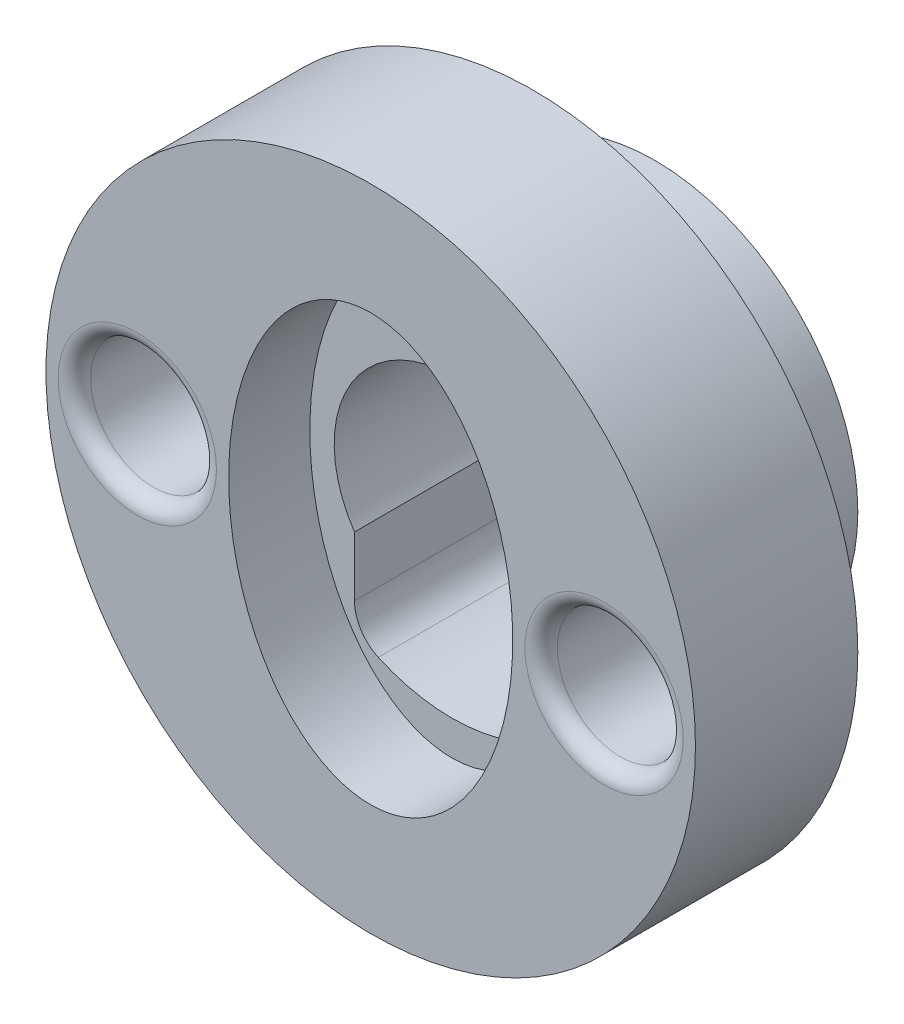
ISO-10303-21;
HEADER;
FILE_DESCRIPTION(('STEP AP214'),'2;1');
FILE_NAME('part.step','',(''),(''),'','','');
FILE_SCHEMA(('AUTOMOTIVE_DESIGN { 1 0 10303 214 1 1 1 1 }'));
ENDSEC;
DATA;
#1=APPLICATION_CONTEXT('core data for automotive mechanical design processes');
#2=APPLICATION_PROTOCOL_DEFINITION('international standard','automotive_design',2000,#1);
#3=PRODUCT_CONTEXT('',#1,'mechanical');
#4=PRODUCT('Part','Part','',(#3));
#5=PRODUCT_RELATED_PRODUCT_CATEGORY('part','',(#4));
#6=PRODUCT_DEFINITION_FORMATION('','',#4);
#7=PRODUCT_DEFINITION_CONTEXT('part definition',#1,'design');
#8=PRODUCT_DEFINITION('design','',#6,#7);
#9=PRODUCT_DEFINITION_SHAPE('','',#8);
#10=(LENGTH_UNIT() NAMED_UNIT(*) SI_UNIT(.MILLI.,.METRE.));
#11=(NAMED_UNIT(*) PLANE_ANGLE_UNIT() SI_UNIT($,.RADIAN.));
#12=(NAMED_UNIT(*) SI_UNIT($,.STERADIAN.) SOLID_ANGLE_UNIT());
#13=UNCERTAINTY_MEASURE_WITH_UNIT(LENGTH_MEASURE(1.E-05),#10,'distance_accuracy_value','');
#14=(GEOMETRIC_REPRESENTATION_CONTEXT(3) GLOBAL_UNCERTAINTY_ASSIGNED_CONTEXT((#13)) GLOBAL_UNIT_ASSIGNED_CONTEXT((#10,
#11,#12)) REPRESENTATION_CONTEXT('',''));
#15=CARTESIAN_POINT('',(0.,0.,0.));
#16=DIRECTION('',(0.,0.,1.));
#17=DIRECTION('',(1.,0.,0.));
#18=AXIS2_PLACEMENT_3D('',#15,#16,#17);
#19=CARTESIAN_POINT('',(0.,0.,0.));
#20=DIRECTION('',(0.,0.,1.));
#21=DIRECTION('',(1.,0.,0.));
#22=AXIS2_PLACEMENT_3D('',#19,#20,#21);
#23=PLANE('',#22);
#24=DIRECTION('',(0.,-1.,0.));
#25=VECTOR('',#24,1.);
#26=CARTESIAN_POINT('',(-2.4,0.,0.));
#27=LINE('',#26,#25);
#28=CARTESIAN_POINT('',(-2.4,-1.62788205960997,0.));
#29=VERTEX_POINT('',#28);
#30=CARTESIAN_POINT('',(-2.4,-3.09838667696593,0.));
#31=VERTEX_POINT('',#30);
#32=EDGE_CURVE('E139',#29,#31,#27,.T.);
#33=ORIENTED_EDGE('',*,*,#32,.T.);
#34=CARTESIAN_POINT('',(-1.4,-3.09838667696593,0.));
#35=DIRECTION('',(0.,0.,1.));
#36=DIRECTION('',(1.,0.,0.));
#37=AXIS2_PLACEMENT_3D('',#34,#35,#36);
#38=CIRCLE('',#37,1.);
#39=CARTESIAN_POINT('',(-1.81176470588235,-4.00967687607356,0.));
#40=VERTEX_POINT('',#39);
#41=EDGE_CURVE('E236',#31,#40,#38,.T.);
#42=ORIENTED_EDGE('',*,*,#41,.T.);
#43=CARTESIAN_POINT('',(0.,0.,0.));
#44=DIRECTION('',(0.,0.,1.));
#45=DIRECTION('',(1.,0.,0.));
#46=AXIS2_PLACEMENT_3D('',#43,#44,#45);
#47=CIRCLE('',#46,4.4);
#48=CARTESIAN_POINT('',(1.81176470588235,-4.00967687607356,0.));
#49=VERTEX_POINT('',#48);
#50=EDGE_CURVE('E142',#40,#49,#47,.T.);
#51=ORIENTED_EDGE('',*,*,#50,.T.);
#52=CARTESIAN_POINT('',(1.4,-3.09838667696593,0.));
#53=DIRECTION('',(0.,0.,1.));
#54=DIRECTION('',(1.,0.,0.));
#55=AXIS2_PLACEMENT_3D('',#52,#53,#54);
#56=CIRCLE('',#55,1.);
#57=CARTESIAN_POINT('',(2.4,-3.09838667696593,0.));
#58=VERTEX_POINT('',#57);
#59=EDGE_CURVE('E66',#49,#58,#56,.T.);
#60=ORIENTED_EDGE('',*,*,#59,.T.);
#61=DIRECTION('',(0.,1.,0.));
#62=VECTOR('',#61,1.);
#63=CARTESIAN_POINT('',(2.4,0.,0.));
#64=LINE('',#63,#62);
#65=CARTESIAN_POINT('',(2.4,-1.62788205960997,0.));
#66=VERTEX_POINT('',#65);
#67=EDGE_CURVE('E135',#58,#66,#64,.T.);
#68=ORIENTED_EDGE('',*,*,#67,.T.);
#69=CARTESIAN_POINT('',(0.,0.,0.));
#70=DIRECTION('',(0.,0.,1.));
#71=DIRECTION('',(1.,0.,0.));
#72=AXIS2_PLACEMENT_3D('',#69,#70,#71);
#73=CIRCLE('',#72,2.9);
#74=EDGE_CURVE('E123',#66,#29,#73,.T.);
#75=ORIENTED_EDGE('',*,*,#74,.T.);
#76=EDGE_LOOP('',(#33,#42,#51,#60,#68,#75));
#77=FACE_BOUND('',#76,.T.);
#78=CARTESIAN_POINT('',(0.,0.,0.));
#79=DIRECTION('',(0.,0.,1.));
#80=DIRECTION('',(1.,0.,0.));
#81=AXIS2_PLACEMENT_3D('',#78,#79,#80);
#82=CIRCLE('',#81,5.);
#83=CARTESIAN_POINT('',(5.,0.,0.));
#84=VERTEX_POINT('',#83);
#85=EDGE_CURVE('E217',#84,#84,#82,.T.);
#86=ORIENTED_EDGE('',*,*,#85,.F.);
#87=EDGE_LOOP('',(#86));
#88=FACE_BOUND('',#87,.T.);
#89=ADVANCED_FACE('F51',(#77,#88),#23,.F.);
#90=CARTESIAN_POINT('',(0.,0.,3.));
#91=DIRECTION('',(0.,0.,-1.));
#92=DIRECTION('',(-1.,0.,0.));
#93=AXIS2_PLACEMENT_3D('',#90,#91,#92);
#94=CYLINDRICAL_SURFACE('',#93,5.);
#95=CARTESIAN_POINT('',(0.,0.,3.));
#96=DIRECTION('',(0.,0.,1.));
#97=DIRECTION('',(1.,0.,0.));
#98=AXIS2_PLACEMENT_3D('',#95,#96,#97);
#99=CIRCLE('',#98,5.);
#100=CARTESIAN_POINT('',(5.,0.,3.));
#101=VERTEX_POINT('',#100);
#102=EDGE_CURVE('E219',#101,#101,#99,.T.);
#103=ORIENTED_EDGE('',*,*,#102,.F.);
#104=EDGE_LOOP('',(#103));
#105=FACE_BOUND('',#104,.T.);
#106=ORIENTED_EDGE('',*,*,#85,.T.);
#107=EDGE_LOOP('',(#106));
#108=FACE_BOUND('',#107,.T.);
#109=ADVANCED_FACE('F175',(#105,#108),#94,.T.);
#110=CARTESIAN_POINT('',(0.,0.,7.));
#111=DIRECTION('',(0.,0.,-1.));
#112=DIRECTION('',(-1.,0.,0.));
#113=AXIS2_PLACEMENT_3D('',#110,#111,#112);
#114=CYLINDRICAL_SURFACE('',#113,8.);
#115=CARTESIAN_POINT('',(0.,0.,7.));
#116=DIRECTION('',(0.,0.,1.));
#117=DIRECTION('',(1.,0.,0.));
#118=AXIS2_PLACEMENT_3D('',#115,#116,#117);
#119=CIRCLE('',#118,8.);
#120=CARTESIAN_POINT('',(8.,0.,7.));
#121=VERTEX_POINT('',#120);
#122=EDGE_CURVE('E216',#121,#121,#119,.T.);
#123=ORIENTED_EDGE('',*,*,#122,.F.);
#124=EDGE_LOOP('',(#123));
#125=FACE_BOUND('',#124,.T.);
#126=CARTESIAN_POINT('',(0.,0.,3.));
#127=DIRECTION('',(0.,0.,1.));
#128=DIRECTION('',(1.,0.,0.));
#129=AXIS2_PLACEMENT_3D('',#126,#127,#128);
#130=CIRCLE('',#129,8.);
#131=CARTESIAN_POINT('',(8.,0.,3.));
#132=VERTEX_POINT('',#131);
#133=EDGE_CURVE('E155',#132,#132,#130,.T.);
#134=ORIENTED_EDGE('',*,*,#133,.T.);
#135=EDGE_LOOP('',(#134));
#136=FACE_BOUND('',#135,.T.);
#137=ADVANCED_FACE('F168',(#125,#136),#114,.T.);
#138=CARTESIAN_POINT('',(0.,0.,7.));
#139=DIRECTION('',(0.,0.,1.));
#140=DIRECTION('',(1.,0.,0.));
#141=AXIS2_PLACEMENT_3D('',#138,#139,#140);
#142=PLANE('',#141);
#143=CARTESIAN_POINT('',(5.75,0.,7.));
#144=DIRECTION('',(0.,0.,1.));
#145=DIRECTION('',(1.,0.,0.));
#146=AXIS2_PLACEMENT_3D('',#143,#144,#145);
#147=CIRCLE('',#146,1.95);
#148=CARTESIAN_POINT('',(7.7,0.,7.));
#149=VERTEX_POINT('',#148);
#150=EDGE_CURVE('E59',#149,#149,#147,.F.);
#151=ORIENTED_EDGE('',*,*,#150,.T.);
#152=EDGE_LOOP('',(#151));
#153=FACE_BOUND('',#152,.T.);
#154=CARTESIAN_POINT('',(-5.75,0.,7.));
#155=DIRECTION('',(0.,0.,1.));
#156=DIRECTION('',(1.,0.,0.));
#157=AXIS2_PLACEMENT_3D('',#154,#155,#156);
#158=CIRCLE('',#157,1.95);
#159=CARTESIAN_POINT('',(-3.8,0.,7.));
#160=VERTEX_POINT('',#159);
#161=EDGE_CURVE('E202',#160,#160,#158,.F.);
#162=ORIENTED_EDGE('',*,*,#161,.T.);
#163=EDGE_LOOP('',(#162));
#164=FACE_BOUND('',#163,.T.);
#165=CARTESIAN_POINT('',(0.,0.,7.));
#166=DIRECTION('',(0.,0.,1.));
#167=DIRECTION('',(0.,-1.,0.));
#168=AXIS2_PLACEMENT_3D('',#165,#166,#167);
#169=ELLIPSE('',#168,5.25,3.5);
#170=CARTESIAN_POINT('',(0.,-5.25,7.));
#171=VERTEX_POINT('',#170);
#172=EDGE_CURVE('E148',#171,#171,#169,.T.);
#173=ORIENTED_EDGE('',*,*,#172,.F.);
#174=EDGE_LOOP('',(#173));
#175=FACE_BOUND('',#174,.T.);
#176=ORIENTED_EDGE('',*,*,#122,.T.);
#177=EDGE_LOOP('',(#176));
#178=FACE_BOUND('',#177,.T.);
#179=ADVANCED_FACE('F165',(#153,#164,#175,#178),#142,.T.);
#180=CARTESIAN_POINT('',(0.,0.,3.));
#181=DIRECTION('',(0.,0.,1.));
#182=DIRECTION('',(1.,0.,0.));
#183=AXIS2_PLACEMENT_3D('',#180,#181,#182);
#184=PLANE('',#183);
#185=ORIENTED_EDGE('',*,*,#102,.T.);
#186=EDGE_LOOP('',(#185));
#187=FACE_BOUND('',#186,.T.);
#188=ORIENTED_EDGE('',*,*,#133,.F.);
#189=EDGE_LOOP('',(#188));
#190=FACE_BOUND('',#189,.T.);
#191=ADVANCED_FACE('F162',(#187,#190),#184,.F.);
#192=CARTESIAN_POINT('',(0.,0.,5.));
#193=DIRECTION('',(0.,0.,1.));
#194=DIRECTION('',(0.,-1.,0.));
#195=AXIS2_PLACEMENT_3D('',#192,#193,#194);
#196=ELLIPSE('',#195,5.25,3.5);
#197=DIRECTION('',(0.,0.,1.));
#198=VECTOR('',#197,1.);
#199=SURFACE_OF_LINEAR_EXTRUSION('',#196,#198);
#200=CARTESIAN_POINT('',(0.,-5.25,5.));
#201=VERTEX_POINT('',#200);
#202=EDGE_CURVE('E151',#201,#201,#196,.T.);
#203=ORIENTED_EDGE('',*,*,#202,.F.);
#204=EDGE_LOOP('',(#203));
#205=FACE_BOUND('',#204,.T.);
#206=ORIENTED_EDGE('',*,*,#172,.T.);
#207=EDGE_LOOP('',(#206));
#208=FACE_BOUND('',#207,.T.);
#209=ADVANCED_FACE('F158',(#205,#208),#199,.F.);
#210=CARTESIAN_POINT('',(0.,0.,5.));
#211=DIRECTION('',(0.,0.,1.));
#212=DIRECTION('',(1.,0.,0.));
#213=AXIS2_PLACEMENT_3D('',#210,#211,#212);
#214=PLANE('',#213);
#215=CARTESIAN_POINT('',(0.,0.,5.));
#216=DIRECTION('',(0.,0.,1.));
#217=DIRECTION('',(1.,0.,0.));
#218=AXIS2_PLACEMENT_3D('',#215,#216,#217);
#219=CIRCLE('',#218,4.4);
#220=CARTESIAN_POINT('',(-1.81176470588235,-4.00967687607356,5.));
#221=VERTEX_POINT('',#220);
#222=CARTESIAN_POINT('',(1.81176470588235,-4.00967687607356,5.));
#223=VERTEX_POINT('',#222);
#224=EDGE_CURVE('E115',#221,#223,#219,.T.);
#225=ORIENTED_EDGE('',*,*,#224,.F.);
#226=CARTESIAN_POINT('',(-1.4,-3.09838667696593,5.));
#227=DIRECTION('',(0.,0.,1.));
#228=DIRECTION('',(1.,0.,0.));
#229=AXIS2_PLACEMENT_3D('',#226,#227,#228);
#230=CIRCLE('',#229,1.);
#231=CARTESIAN_POINT('',(-2.4,-3.09838667696593,5.));
#232=VERTEX_POINT('',#231);
#233=EDGE_CURVE('E234',#221,#232,#230,.F.);
#234=ORIENTED_EDGE('',*,*,#233,.T.);
#235=DIRECTION('',(0.,-1.,0.));
#236=VECTOR('',#235,1.);
#237=CARTESIAN_POINT('',(-2.4,-3.68781778291715,5.));
#238=LINE('',#237,#236);
#239=CARTESIAN_POINT('',(-2.4,-1.62788205960997,5.));
#240=VERTEX_POINT('',#239);
#241=EDGE_CURVE('E125',#240,#232,#238,.T.);
#242=ORIENTED_EDGE('',*,*,#241,.F.);
#243=CARTESIAN_POINT('',(0.,0.,5.));
#244=DIRECTION('',(0.,0.,1.));
#245=DIRECTION('',(1.,0.,0.));
#246=AXIS2_PLACEMENT_3D('',#243,#244,#245);
#247=CIRCLE('',#246,2.9);
#248=CARTESIAN_POINT('',(2.4,-1.62788205960997,5.));
#249=VERTEX_POINT('',#248);
#250=EDGE_CURVE('E114',#249,#240,#247,.T.);
#251=ORIENTED_EDGE('',*,*,#250,.F.);
#252=DIRECTION('',(0.,1.,0.));
#253=VECTOR('',#252,1.);
#254=CARTESIAN_POINT('',(2.4,-3.68781778291715,5.));
#255=LINE('',#254,#253);
#256=CARTESIAN_POINT('',(2.4,-3.09838667696593,5.));
#257=VERTEX_POINT('',#256);
#258=EDGE_CURVE('E106',#257,#249,#255,.T.);
#259=ORIENTED_EDGE('',*,*,#258,.F.);
#260=CARTESIAN_POINT('',(1.4,-3.09838667696593,5.));
#261=DIRECTION('',(0.,0.,1.));
#262=DIRECTION('',(1.,0.,0.));
#263=AXIS2_PLACEMENT_3D('',#260,#261,#262);
#264=CIRCLE('',#263,1.);
#265=EDGE_CURVE('E74',#257,#223,#264,.F.);
#266=ORIENTED_EDGE('',*,*,#265,.T.);
#267=EDGE_LOOP('',(#225,#234,#242,#251,#259,#266));
#268=FACE_BOUND('',#267,.T.);
#269=ORIENTED_EDGE('',*,*,#202,.T.);
#270=EDGE_LOOP('',(#269));
#271=FACE_BOUND('',#270,.T.);
#272=ADVANCED_FACE('F128',(#268,#271),#214,.T.);
#273=CARTESIAN_POINT('',(5.75,0.,3.5));
#274=DIRECTION('',(0.,0.,1.));
#275=DIRECTION('',(1.,0.,0.));
#276=AXIS2_PLACEMENT_3D('',#273,#274,#275);
#277=CYLINDRICAL_SURFACE('',#276,1.55);
#278=CARTESIAN_POINT('',(5.75,0.,6.6));
#279=DIRECTION('',(0.,0.,1.));
#280=DIRECTION('',(1.,0.,0.));
#281=AXIS2_PLACEMENT_3D('',#278,#279,#280);
#282=CIRCLE('',#281,1.55);
#283=CARTESIAN_POINT('',(7.3,0.,6.6));
#284=VERTEX_POINT('',#283);
#285=EDGE_CURVE('E200',#284,#284,#282,.T.);
#286=ORIENTED_EDGE('',*,*,#285,.T.);
#287=EDGE_LOOP('',(#286));
#288=FACE_BOUND('',#287,.T.);
#289=CARTESIAN_POINT('',(5.75,0.,3.5));
#290=DIRECTION('',(0.,0.,1.));
#291=DIRECTION('',(1.,0.,0.));
#292=AXIS2_PLACEMENT_3D('',#289,#290,#291);
#293=CIRCLE('',#292,1.55);
#294=CARTESIAN_POINT('',(7.3,0.,3.5));
#295=VERTEX_POINT('',#294);
#296=EDGE_CURVE('E144',#295,#295,#293,.T.);
#297=ORIENTED_EDGE('',*,*,#296,.F.);
#298=EDGE_LOOP('',(#297));
#299=FACE_BOUND('',#298,.T.);
#300=ADVANCED_FACE('F270',(#288,#299),#277,.F.);
#301=CARTESIAN_POINT('',(0.,0.,3.5));
#302=DIRECTION('',(0.,0.,1.));
#303=DIRECTION('',(1.,0.,0.));
#304=AXIS2_PLACEMENT_3D('',#301,#302,#303);
#305=PLANE('',#304);
#306=ORIENTED_EDGE('',*,*,#296,.T.);
#307=EDGE_LOOP('',(#306));
#308=FACE_BOUND('',#307,.T.);
#309=ADVANCED_FACE('F267',(#308),#305,.T.);
#310=CARTESIAN_POINT('',(-5.75,0.,3.5));
#311=DIRECTION('',(0.,0.,1.));
#312=DIRECTION('',(1.,0.,0.));
#313=AXIS2_PLACEMENT_3D('',#310,#311,#312);
#314=CYLINDRICAL_SURFACE('',#313,1.55);
#315=CARTESIAN_POINT('',(-5.75,0.,6.6));
#316=DIRECTION('',(0.,0.,1.));
#317=DIRECTION('',(1.,0.,0.));
#318=AXIS2_PLACEMENT_3D('',#315,#316,#317);
#319=CIRCLE('',#318,1.55);
#320=CARTESIAN_POINT('',(-4.2,0.,6.6));
#321=VERTEX_POINT('',#320);
#322=EDGE_CURVE('E12',#321,#321,#319,.T.);
#323=ORIENTED_EDGE('',*,*,#322,.T.);
#324=EDGE_LOOP('',(#323));
#325=FACE_BOUND('',#324,.T.);
#326=CARTESIAN_POINT('',(-5.75,0.,3.5));
#327=DIRECTION('',(0.,0.,1.));
#328=DIRECTION('',(1.,0.,0.));
#329=AXIS2_PLACEMENT_3D('',#326,#327,#328);
#330=CIRCLE('',#329,1.55);
#331=CARTESIAN_POINT('',(-4.2,0.,3.5));
#332=VERTEX_POINT('',#331);
#333=EDGE_CURVE('E145',#332,#332,#330,.T.);
#334=ORIENTED_EDGE('',*,*,#333,.F.);
#335=EDGE_LOOP('',(#334));
#336=FACE_BOUND('',#335,.T.);
#337=ADVANCED_FACE('F263',(#325,#336),#314,.F.);
#338=CARTESIAN_POINT('',(0.,0.,3.5));
#339=DIRECTION('',(0.,0.,1.));
#340=DIRECTION('',(1.,0.,0.));
#341=AXIS2_PLACEMENT_3D('',#338,#339,#340);
#342=PLANE('',#341);
#343=ORIENTED_EDGE('',*,*,#333,.T.);
#344=EDGE_LOOP('',(#343));
#345=FACE_BOUND('',#344,.T.);
#346=ADVANCED_FACE('F256',(#345),#342,.T.);
#347=CARTESIAN_POINT('',(0.,0.,-5.));
#348=DIRECTION('',(0.,0.,1.));
#349=DIRECTION('',(1.,0.,0.));
#350=AXIS2_PLACEMENT_3D('',#347,#348,#349);
#351=CYLINDRICAL_SURFACE('',#350,4.4);
#352=ORIENTED_EDGE('',*,*,#50,.F.);
#353=DIRECTION('',(0.,0.,1.));
#354=VECTOR('',#353,1.);
#355=CARTESIAN_POINT('',(-1.81176470588235,-4.00967687607356,-5.));
#356=LINE('',#355,#354);
#357=EDGE_CURVE('E228',#40,#221,#356,.T.);
#358=ORIENTED_EDGE('',*,*,#357,.T.);
#359=ORIENTED_EDGE('',*,*,#224,.T.);
#360=DIRECTION('',(0.,0.,1.));
#361=VECTOR('',#360,1.);
#362=CARTESIAN_POINT('',(1.81176470588235,-4.00967687607356,-5.));
#363=LINE('',#362,#361);
#364=EDGE_CURVE('E225',#223,#49,#363,.F.);
#365=ORIENTED_EDGE('',*,*,#364,.T.);
#366=EDGE_LOOP('',(#352,#358,#359,#365));
#367=FACE_BOUND('',#366,.T.);
#368=ADVANCED_FACE('F240',(#367),#351,.F.);
#369=CARTESIAN_POINT('',(-2.4,-3.68781778291715,-5.));
#370=DIRECTION('',(-1.,0.,0.));
#371=DIRECTION('',(0.,0.,1.));
#372=AXIS2_PLACEMENT_3D('',#369,#370,#371);
#373=PLANE('',#372);
#374=ORIENTED_EDGE('',*,*,#241,.T.);
#375=DIRECTION('',(0.,0.,-1.));
#376=VECTOR('',#375,1.);
#377=CARTESIAN_POINT('',(-2.4,-3.09838667696593,0.));
#378=LINE('',#377,#376);
#379=EDGE_CURVE('E231',#232,#31,#378,.T.);
#380=ORIENTED_EDGE('',*,*,#379,.T.);
#381=ORIENTED_EDGE('',*,*,#32,.F.);
#382=DIRECTION('',(0.,0.,1.));
#383=VECTOR('',#382,1.);
#384=CARTESIAN_POINT('',(-2.4,-1.62788205960997,-5.));
#385=LINE('',#384,#383);
#386=EDGE_CURVE('E124',#29,#240,#385,.T.);
#387=ORIENTED_EDGE('',*,*,#386,.T.);
#388=EDGE_LOOP('',(#374,#380,#381,#387));
#389=FACE_BOUND('',#388,.T.);
#390=ADVANCED_FACE('F245',(#389),#373,.F.);
#391=CARTESIAN_POINT('',(0.,0.,-5.));
#392=DIRECTION('',(0.,0.,1.));
#393=DIRECTION('',(1.,0.,0.));
#394=AXIS2_PLACEMENT_3D('',#391,#392,#393);
#395=CYLINDRICAL_SURFACE('',#394,2.9);
#396=DIRECTION('',(0.,0.,1.));
#397=VECTOR('',#396,1.);
#398=CARTESIAN_POINT('',(2.4,-1.62788205960997,-5.));
#399=LINE('',#398,#397);
#400=EDGE_CURVE('E109',#66,#249,#399,.T.);
#401=ORIENTED_EDGE('',*,*,#400,.T.);
#402=ORIENTED_EDGE('',*,*,#250,.T.);
#403=ORIENTED_EDGE('',*,*,#386,.F.);
#404=ORIENTED_EDGE('',*,*,#74,.F.);
#405=EDGE_LOOP('',(#401,#402,#403,#404));
#406=FACE_BOUND('',#405,.T.);
#407=ADVANCED_FACE('F119',(#406),#395,.F.);
#408=CARTESIAN_POINT('',(2.4,-3.68781778291715,-5.));
#409=DIRECTION('',(1.,0.,0.));
#410=DIRECTION('',(0.,0.,-1.));
#411=AXIS2_PLACEMENT_3D('',#408,#409,#410);
#412=PLANE('',#411);
#413=ORIENTED_EDGE('',*,*,#67,.F.);
#414=DIRECTION('',(0.,0.,-1.));
#415=VECTOR('',#414,1.);
#416=CARTESIAN_POINT('',(2.4,-3.09838667696593,5.));
#417=LINE('',#416,#415);
#418=EDGE_CURVE('E111',#58,#257,#417,.F.);
#419=ORIENTED_EDGE('',*,*,#418,.T.);
#420=ORIENTED_EDGE('',*,*,#258,.T.);
#421=ORIENTED_EDGE('',*,*,#400,.F.);
#422=EDGE_LOOP('',(#413,#419,#420,#421));
#423=FACE_BOUND('',#422,.T.);
#424=ADVANCED_FACE('F108',(#423),#412,.F.);
#425=CARTESIAN_POINT('',(-1.4,-3.09838667696593,-5.));
#426=DIRECTION('',(0.,0.,1.));
#427=DIRECTION('',(1.,0.,0.));
#428=AXIS2_PLACEMENT_3D('',#425,#426,#427);
#429=CYLINDRICAL_SURFACE('',#428,1.);
#430=ORIENTED_EDGE('',*,*,#41,.F.);
#431=ORIENTED_EDGE('',*,*,#379,.F.);
#432=ORIENTED_EDGE('',*,*,#233,.F.);
#433=ORIENTED_EDGE('',*,*,#357,.F.);
#434=EDGE_LOOP('',(#430,#431,#432,#433));
#435=FACE_BOUND('',#434,.T.);
#436=ADVANCED_FACE('F182',(#435),#429,.F.);
#437=CARTESIAN_POINT('',(1.4,-3.09838667696593,-5.));
#438=DIRECTION('',(0.,0.,1.));
#439=DIRECTION('',(1.,0.,0.));
#440=AXIS2_PLACEMENT_3D('',#437,#438,#439);
#441=CYLINDRICAL_SURFACE('',#440,1.);
#442=ORIENTED_EDGE('',*,*,#59,.F.);
#443=ORIENTED_EDGE('',*,*,#364,.F.);
#444=ORIENTED_EDGE('',*,*,#265,.F.);
#445=ORIENTED_EDGE('',*,*,#418,.F.);
#446=EDGE_LOOP('',(#442,#443,#444,#445));
#447=FACE_BOUND('',#446,.T.);
#448=ADVANCED_FACE('F185',(#447),#441,.F.);
#449=CARTESIAN_POINT('',(5.75,0.,6.6));
#450=DIRECTION('',(0.,0.,1.));
#451=DIRECTION('',(1.,0.,0.));
#452=AXIS2_PLACEMENT_3D('',#449,#450,#451);
#453=TOROIDAL_SURFACE('',#452,1.95,0.4);
#454=ORIENTED_EDGE('',*,*,#150,.F.);
#455=EDGE_LOOP('',(#454));
#456=FACE_BOUND('',#455,.T.);
#457=ORIENTED_EDGE('',*,*,#285,.F.);
#458=EDGE_LOOP('',(#457));
#459=FACE_BOUND('',#458,.T.);
#460=ADVANCED_FACE('F188',(#456,#459),#453,.T.);
#461=CARTESIAN_POINT('',(-5.75,0.,6.6));
#462=DIRECTION('',(0.,0.,1.));
#463=DIRECTION('',(1.,0.,0.));
#464=AXIS2_PLACEMENT_3D('',#461,#462,#463);
#465=TOROIDAL_SURFACE('',#464,1.95,0.4);
#466=ORIENTED_EDGE('',*,*,#161,.F.);
#467=EDGE_LOOP('',(#466));
#468=FACE_BOUND('',#467,.T.);
#469=ORIENTED_EDGE('',*,*,#322,.F.);
#470=EDGE_LOOP('',(#469));
#471=FACE_BOUND('',#470,.T.);
#472=ADVANCED_FACE('F53',(#468,#471),#465,.T.);
#473=CLOSED_SHELL('',(#89,#109,#137,#179,#191,#209,#272,#300,#309,#337,#346,#368,#390,#407,#424,
#436,#448,#460,#472));
#474=MANIFOLD_SOLID_BREP('B2',#473);
#475=ADVANCED_BREP_SHAPE_REPRESENTATION('',(#18,#474),#14);
#476=SHAPE_DEFINITION_REPRESENTATION(#9,#475);
ENDSEC;
END-ISO-10303-21;
